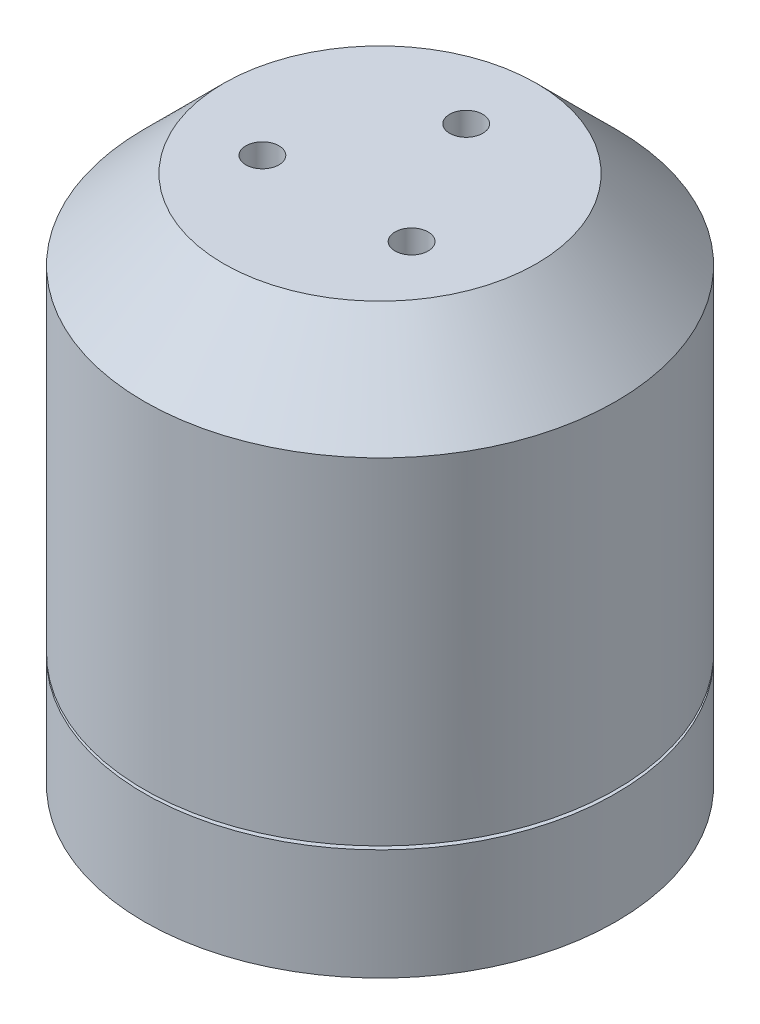
ISO-10303-21;
HEADER;
FILE_DESCRIPTION(('STEP AP214'),'2;1');
FILE_NAME('part.step','',(''),(''),'','','');
FILE_SCHEMA(('AUTOMOTIVE_DESIGN { 1 0 10303 214 1 1 1 1 }'));
ENDSEC;
DATA;
#1=APPLICATION_CONTEXT('core data for automotive mechanical design processes');
#2=APPLICATION_PROTOCOL_DEFINITION('international standard','automotive_design',2000,#1);
#3=PRODUCT_CONTEXT('',#1,'mechanical');
#4=PRODUCT('Part','Part','',(#3));
#5=PRODUCT_RELATED_PRODUCT_CATEGORY('part','',(#4));
#6=PRODUCT_DEFINITION_FORMATION('','',#4);
#7=PRODUCT_DEFINITION_CONTEXT('part definition',#1,'design');
#8=PRODUCT_DEFINITION('design','',#6,#7);
#9=PRODUCT_DEFINITION_SHAPE('','',#8);
#10=(LENGTH_UNIT() NAMED_UNIT(*) SI_UNIT(.MILLI.,.METRE.));
#11=(NAMED_UNIT(*) PLANE_ANGLE_UNIT() SI_UNIT($,.RADIAN.));
#12=(NAMED_UNIT(*) SI_UNIT($,.STERADIAN.) SOLID_ANGLE_UNIT());
#13=UNCERTAINTY_MEASURE_WITH_UNIT(LENGTH_MEASURE(1.E-05),#10,'distance_accuracy_value','');
#14=(GEOMETRIC_REPRESENTATION_CONTEXT(3) GLOBAL_UNCERTAINTY_ASSIGNED_CONTEXT((#13)) GLOBAL_UNIT_ASSIGNED_CONTEXT((#10,
#11,#12)) REPRESENTATION_CONTEXT('',''));
#15=CARTESIAN_POINT('',(0.,0.,0.));
#16=DIRECTION('',(0.,0.,1.));
#17=DIRECTION('',(1.,0.,0.));
#18=AXIS2_PLACEMENT_3D('',#15,#16,#17);
#19=CARTESIAN_POINT('',(0.,20.,0.));
#20=DIRECTION('',(0.,-1.,0.));
#21=DIRECTION('',(0.,0.,-1.));
#22=AXIS2_PLACEMENT_3D('',#19,#20,#21);
#23=CYLINDRICAL_SURFACE('',#22,17.8);
#24=CARTESIAN_POINT('',(0.,14.,0.));
#25=DIRECTION('',(0.,1.,0.));
#26=DIRECTION('',(0.,0.,1.));
#27=AXIS2_PLACEMENT_3D('',#24,#25,#26);
#28=CIRCLE('',#27,17.8);
#29=CARTESIAN_POINT('',(0.,14.,17.8));
#30=VERTEX_POINT('',#29);
#31=EDGE_CURVE('E10',#30,#30,#28,.F.);
#32=ORIENTED_EDGE('',*,*,#31,.T.);
#33=EDGE_LOOP('',(#32));
#34=FACE_BOUND('',#33,.T.);
#35=CARTESIAN_POINT('',(0.,-11.364,0.));
#36=DIRECTION('',(0.,-1.,0.));
#37=DIRECTION('',(0.,0.,-1.));
#38=AXIS2_PLACEMENT_3D('',#35,#36,#37);
#39=CIRCLE('',#38,17.8);
#40=CARTESIAN_POINT('',(0.,-11.364,-17.8));
#41=VERTEX_POINT('',#40);
#42=EDGE_CURVE('E54',#41,#41,#39,.T.);
#43=ORIENTED_EDGE('',*,*,#42,.F.);
#44=EDGE_LOOP('',(#43));
#45=FACE_BOUND('',#44,.T.);
#46=ADVANCED_FACE('F34',(#34,#45),#23,.T.);
#47=CARTESIAN_POINT('',(0.,20.,0.));
#48=DIRECTION('',(0.,1.,0.));
#49=DIRECTION('',(0.,0.,1.));
#50=AXIS2_PLACEMENT_3D('',#47,#48,#49);
#51=PLANE('',#50);
#52=CARTESIAN_POINT('',(0.,20.,0.));
#53=DIRECTION('',(0.,1.,0.));
#54=DIRECTION('',(0.,0.,1.));
#55=AXIS2_PLACEMENT_3D('',#52,#53,#54);
#56=CIRCLE('',#55,11.8);
#57=CARTESIAN_POINT('',(0.,20.,11.8));
#58=VERTEX_POINT('',#57);
#59=EDGE_CURVE('E43',#58,#58,#56,.T.);
#60=ORIENTED_EDGE('',*,*,#59,.T.);
#61=EDGE_LOOP('',(#60));
#62=FACE_BOUND('',#61,.T.);
#63=CARTESIAN_POINT('',(5.62916512459884,20.,3.25000000000003));
#64=DIRECTION('',(0.,1.,0.));
#65=DIRECTION('',(-0.866025403784436,0.,-0.500000000000004));
#66=AXIS2_PLACEMENT_3D('',#63,#64,#65);
#67=CIRCLE('',#66,1.25);
#68=CARTESIAN_POINT('',(4.54663336986829,20.,2.62500000000002));
#69=VERTEX_POINT('',#68);
#70=EDGE_CURVE('E115',#69,#69,#67,.T.);
#71=ORIENTED_EDGE('',*,*,#70,.F.);
#72=EDGE_LOOP('',(#71));
#73=FACE_BOUND('',#72,.T.);
#74=CARTESIAN_POINT('',(-5.62916512459888,20.,3.24999999999995));
#75=DIRECTION('',(0.,1.,0.));
#76=DIRECTION('',(0.866025403784443,0.,-0.499999999999992));
#77=AXIS2_PLACEMENT_3D('',#74,#75,#76);
#78=CIRCLE('',#77,1.25);
#79=CARTESIAN_POINT('',(-4.54663336986833,20.,2.62499999999996));
#80=VERTEX_POINT('',#79);
#81=EDGE_CURVE('E108',#80,#80,#78,.T.);
#82=ORIENTED_EDGE('',*,*,#81,.F.);
#83=EDGE_LOOP('',(#82));
#84=FACE_BOUND('',#83,.T.);
#85=CARTESIAN_POINT('',(0.,20.,-6.5));
#86=DIRECTION('',(0.,1.,0.));
#87=DIRECTION('',(0.,0.,1.));
#88=AXIS2_PLACEMENT_3D('',#85,#86,#87);
#89=CIRCLE('',#88,1.25);
#90=CARTESIAN_POINT('',(0.,20.,-5.25));
#91=VERTEX_POINT('',#90);
#92=EDGE_CURVE('E114',#91,#91,#89,.T.);
#93=ORIENTED_EDGE('',*,*,#92,.F.);
#94=EDGE_LOOP('',(#93));
#95=FACE_BOUND('',#94,.T.);
#96=ADVANCED_FACE('F152',(#62,#73,#84,#95),#51,.T.);
#97=CARTESIAN_POINT('',(0.,7.3,-6.5));
#98=DIRECTION('',(0.,1.,0.));
#99=DIRECTION('',(0.,0.,1.));
#100=AXIS2_PLACEMENT_3D('',#97,#98,#99);
#101=CYLINDRICAL_SURFACE('',#100,1.25);
#102=CARTESIAN_POINT('',(0.,7.3,-6.5));
#103=DIRECTION('',(0.,1.,0.));
#104=DIRECTION('',(0.,0.,1.));
#105=AXIS2_PLACEMENT_3D('',#102,#103,#104);
#106=CIRCLE('',#105,1.25);
#107=CARTESIAN_POINT('',(0.,7.3,-5.25));
#108=VERTEX_POINT('',#107);
#109=EDGE_CURVE('E123',#108,#108,#106,.T.);
#110=ORIENTED_EDGE('',*,*,#109,.F.);
#111=EDGE_LOOP('',(#110));
#112=FACE_BOUND('',#111,.T.);
#113=ORIENTED_EDGE('',*,*,#92,.T.);
#114=EDGE_LOOP('',(#113));
#115=FACE_BOUND('',#114,.T.);
#116=ADVANCED_FACE('F156',(#112,#115),#101,.F.);
#117=CARTESIAN_POINT('',(0.,7.3,-6.5));
#118=DIRECTION('',(0.,1.,0.));
#119=DIRECTION('',(0.,0.,1.));
#120=AXIS2_PLACEMENT_3D('',#117,#118,#119);
#121=PLANE('',#120);
#122=ORIENTED_EDGE('',*,*,#109,.T.);
#123=EDGE_LOOP('',(#122));
#124=FACE_BOUND('',#123,.T.);
#125=ADVANCED_FACE('F297',(#124),#121,.T.);
#126=CARTESIAN_POINT('',(-5.62916512459888,7.3,3.24999999999995));
#127=DIRECTION('',(0.,1.,0.));
#128=DIRECTION('',(0.,0.,1.));
#129=AXIS2_PLACEMENT_3D('',#126,#127,#128);
#130=CYLINDRICAL_SURFACE('',#129,1.25);
#131=CARTESIAN_POINT('',(-5.62916512459888,7.3,3.24999999999995));
#132=DIRECTION('',(0.,1.,0.));
#133=DIRECTION('',(0.866025403784443,0.,-0.499999999999992));
#134=AXIS2_PLACEMENT_3D('',#131,#132,#133);
#135=CIRCLE('',#134,1.25);
#136=CARTESIAN_POINT('',(-4.54663336986833,7.3,2.62499999999996));
#137=VERTEX_POINT('',#136);
#138=EDGE_CURVE('E118',#137,#137,#135,.T.);
#139=ORIENTED_EDGE('',*,*,#138,.F.);
#140=EDGE_LOOP('',(#139));
#141=FACE_BOUND('',#140,.T.);
#142=ORIENTED_EDGE('',*,*,#81,.T.);
#143=EDGE_LOOP('',(#142));
#144=FACE_BOUND('',#143,.T.);
#145=ADVANCED_FACE('F305',(#141,#144),#130,.F.);
#146=CARTESIAN_POINT('',(-5.62916512459888,7.3,3.24999999999995));
#147=DIRECTION('',(0.,1.,0.));
#148=DIRECTION('',(0.866025403784443,0.,-0.499999999999992));
#149=AXIS2_PLACEMENT_3D('',#146,#147,#148);
#150=PLANE('',#149);
#151=ORIENTED_EDGE('',*,*,#138,.T.);
#152=EDGE_LOOP('',(#151));
#153=FACE_BOUND('',#152,.T.);
#154=ADVANCED_FACE('F313',(#153),#150,.T.);
#155=CARTESIAN_POINT('',(5.62916512459884,7.3,3.25000000000003));
#156=DIRECTION('',(0.,1.,0.));
#157=DIRECTION('',(0.,0.,1.));
#158=AXIS2_PLACEMENT_3D('',#155,#156,#157);
#159=CYLINDRICAL_SURFACE('',#158,1.25);
#160=CARTESIAN_POINT('',(5.62916512459884,7.3,3.25000000000003));
#161=DIRECTION('',(0.,1.,0.));
#162=DIRECTION('',(-0.866025403784436,0.,-0.500000000000004));
#163=AXIS2_PLACEMENT_3D('',#160,#161,#162);
#164=CIRCLE('',#163,1.25);
#165=CARTESIAN_POINT('',(4.54663336986829,7.3,2.62500000000002));
#166=VERTEX_POINT('',#165);
#167=EDGE_CURVE('E111',#166,#166,#164,.T.);
#168=ORIENTED_EDGE('',*,*,#167,.F.);
#169=EDGE_LOOP('',(#168));
#170=FACE_BOUND('',#169,.T.);
#171=ORIENTED_EDGE('',*,*,#70,.T.);
#172=EDGE_LOOP('',(#171));
#173=FACE_BOUND('',#172,.T.);
#174=ADVANCED_FACE('F321',(#170,#173),#159,.F.);
#175=CARTESIAN_POINT('',(5.62916512459884,7.3,3.25000000000003));
#176=DIRECTION('',(0.,1.,0.));
#177=DIRECTION('',(-0.866025403784436,0.,-0.500000000000004));
#178=AXIS2_PLACEMENT_3D('',#175,#176,#177);
#179=PLANE('',#178);
#180=ORIENTED_EDGE('',*,*,#167,.T.);
#181=EDGE_LOOP('',(#180));
#182=FACE_BOUND('',#181,.T.);
#183=ADVANCED_FACE('F221',(#182),#179,.T.);
#184=CARTESIAN_POINT('',(0.,20.,0.));
#185=DIRECTION('',(0.,-1.,0.));
#186=DIRECTION('',(0.,0.,-1.));
#187=AXIS2_PLACEMENT_3D('',#184,#185,#186);
#188=CONICAL_SURFACE('',#187,11.8,0.785398163397446);
#189=ORIENTED_EDGE('',*,*,#31,.F.);
#190=EDGE_LOOP('',(#189));
#191=FACE_BOUND('',#190,.T.);
#192=ORIENTED_EDGE('',*,*,#59,.F.);
#193=EDGE_LOOP('',(#192));
#194=FACE_BOUND('',#193,.T.);
#195=ADVANCED_FACE('F37',(#191,#194),#188,.T.);
#196=CARTESIAN_POINT('',(0.,-11.364,0.));
#197=DIRECTION('',(0.,-1.,0.));
#198=DIRECTION('',(0.,0.,-1.));
#199=AXIS2_PLACEMENT_3D('',#196,#197,#198);
#200=PLANE('',#199);
#201=CARTESIAN_POINT('',(0.,-11.364,0.));
#202=DIRECTION('',(0.,-1.,0.));
#203=DIRECTION('',(0.,0.,-1.));
#204=AXIS2_PLACEMENT_3D('',#201,#202,#203);
#205=CIRCLE('',#204,2.5);
#206=CARTESIAN_POINT('',(0.,-11.364,-2.5));
#207=VERTEX_POINT('',#206);
#208=EDGE_CURVE('E66',#207,#207,#205,.T.);
#209=ORIENTED_EDGE('',*,*,#208,.F.);
#210=EDGE_LOOP('',(#209));
#211=FACE_BOUND('',#210,.T.);
#212=ORIENTED_EDGE('',*,*,#42,.T.);
#213=EDGE_LOOP('',(#212));
#214=FACE_BOUND('',#213,.T.);
#215=CARTESIAN_POINT('',(12.5,-11.364,0.));
#216=DIRECTION('',(0.,-1.,0.));
#217=DIRECTION('',(0.,0.,-1.));
#218=AXIS2_PLACEMENT_3D('',#215,#216,#217);
#219=CIRCLE('',#218,1.5);
#220=CARTESIAN_POINT('',(12.5,-11.364,-1.50000000000004));
#221=VERTEX_POINT('',#220);
#222=EDGE_CURVE('E39',#221,#221,#219,.F.);
#223=ORIENTED_EDGE('',*,*,#222,.T.);
#224=EDGE_LOOP('',(#223));
#225=FACE_BOUND('',#224,.T.);
#226=CARTESIAN_POINT('',(0.,-11.364,-12.5));
#227=DIRECTION('',(0.,-1.,0.));
#228=DIRECTION('',(0.,0.,-1.));
#229=AXIS2_PLACEMENT_3D('',#226,#227,#228);
#230=CIRCLE('',#229,1.5);
#231=CARTESIAN_POINT('',(0.,-11.364,-14.));
#232=VERTEX_POINT('',#231);
#233=EDGE_CURVE('E77',#232,#232,#230,.F.);
#234=ORIENTED_EDGE('',*,*,#233,.T.);
#235=EDGE_LOOP('',(#234));
#236=FACE_BOUND('',#235,.T.);
#237=CARTESIAN_POINT('',(-12.5,-11.364,1.30930550206618E-13));
#238=DIRECTION('',(0.,-1.,0.));
#239=DIRECTION('',(0.,0.,-1.));
#240=AXIS2_PLACEMENT_3D('',#237,#238,#239);
#241=CIRCLE('',#240,1.5);
#242=CARTESIAN_POINT('',(-12.5,-11.364,-1.49999999999987));
#243=VERTEX_POINT('',#242);
#244=EDGE_CURVE('E80',#243,#243,#241,.F.);
#245=ORIENTED_EDGE('',*,*,#244,.T.);
#246=EDGE_LOOP('',(#245));
#247=FACE_BOUND('',#246,.T.);
#248=CARTESIAN_POINT('',(0.,-11.364,12.5));
#249=DIRECTION('',(0.,-1.,0.));
#250=DIRECTION('',(0.,0.,-1.));
#251=AXIS2_PLACEMENT_3D('',#248,#249,#250);
#252=CIRCLE('',#251,1.5);
#253=CARTESIAN_POINT('',(0.,-11.364,11.));
#254=VERTEX_POINT('',#253);
#255=EDGE_CURVE('E83',#254,#254,#252,.F.);
#256=ORIENTED_EDGE('',*,*,#255,.T.);
#257=EDGE_LOOP('',(#256));
#258=FACE_BOUND('',#257,.T.);
#259=ADVANCED_FACE('F177',(#211,#214,#225,#236,#247,#258),#200,.T.);
#260=CARTESIAN_POINT('',(0.,-11.618,0.));
#261=DIRECTION('',(0.,-1.,0.));
#262=DIRECTION('',(0.,0.,-1.));
#263=AXIS2_PLACEMENT_3D('',#260,#261,#262);
#264=PLANE('',#263);
#265=CARTESIAN_POINT('',(-12.5,-11.618,1.30930550206618E-13));
#266=DIRECTION('',(0.,-1.,0.));
#267=DIRECTION('',(0.,0.,-1.));
#268=AXIS2_PLACEMENT_3D('',#265,#266,#267);
#269=CIRCLE('',#268,1.5);
#270=CARTESIAN_POINT('',(-12.5,-11.618,-1.49999999999987));
#271=VERTEX_POINT('',#270);
#272=EDGE_CURVE('E58',#271,#271,#269,.F.);
#273=ORIENTED_EDGE('',*,*,#272,.F.);
#274=EDGE_LOOP('',(#273));
#275=FACE_BOUND('',#274,.T.);
#276=CARTESIAN_POINT('',(12.5,-11.618,0.));
#277=DIRECTION('',(0.,-1.,0.));
#278=DIRECTION('',(0.,0.,-1.));
#279=AXIS2_PLACEMENT_3D('',#276,#277,#278);
#280=CIRCLE('',#279,1.5);
#281=CARTESIAN_POINT('',(12.5,-11.618,-1.50000000000004));
#282=VERTEX_POINT('',#281);
#283=EDGE_CURVE('E51',#282,#282,#280,.F.);
#284=ORIENTED_EDGE('',*,*,#283,.F.);
#285=EDGE_LOOP('',(#284));
#286=FACE_BOUND('',#285,.T.);
#287=CARTESIAN_POINT('',(0.,-11.618,0.));
#288=DIRECTION('',(0.,-1.,0.));
#289=DIRECTION('',(0.,0.,-1.));
#290=AXIS2_PLACEMENT_3D('',#287,#288,#289);
#291=CIRCLE('',#290,2.5);
#292=CARTESIAN_POINT('',(0.,-11.618,-2.5));
#293=VERTEX_POINT('',#292);
#294=EDGE_CURVE('E69',#293,#293,#291,.T.);
#295=ORIENTED_EDGE('',*,*,#294,.T.);
#296=EDGE_LOOP('',(#295));
#297=FACE_BOUND('',#296,.T.);
#298=CARTESIAN_POINT('',(0.,-11.618,0.));
#299=DIRECTION('',(0.,-1.,0.));
#300=DIRECTION('',(0.,0.,-1.));
#301=AXIS2_PLACEMENT_3D('',#298,#299,#300);
#302=CIRCLE('',#301,17.8);
#303=CARTESIAN_POINT('',(0.,-11.618,-17.8));
#304=VERTEX_POINT('',#303);
#305=EDGE_CURVE('E61',#304,#304,#302,.T.);
#306=ORIENTED_EDGE('',*,*,#305,.F.);
#307=EDGE_LOOP('',(#306));
#308=FACE_BOUND('',#307,.T.);
#309=CARTESIAN_POINT('',(0.,-11.618,-12.5));
#310=DIRECTION('',(0.,-1.,0.));
#311=DIRECTION('',(0.,0.,-1.));
#312=AXIS2_PLACEMENT_3D('',#309,#310,#311);
#313=CIRCLE('',#312,1.5);
#314=CARTESIAN_POINT('',(0.,-11.618,-14.));
#315=VERTEX_POINT('',#314);
#316=EDGE_CURVE('E53',#315,#315,#313,.F.);
#317=ORIENTED_EDGE('',*,*,#316,.F.);
#318=EDGE_LOOP('',(#317));
#319=FACE_BOUND('',#318,.T.);
#320=CARTESIAN_POINT('',(0.,-11.618,12.5));
#321=DIRECTION('',(0.,-1.,0.));
#322=DIRECTION('',(0.,0.,-1.));
#323=AXIS2_PLACEMENT_3D('',#320,#321,#322);
#324=CIRCLE('',#323,1.5);
#325=CARTESIAN_POINT('',(0.,-11.618,11.));
#326=VERTEX_POINT('',#325);
#327=EDGE_CURVE('E74',#326,#326,#324,.F.);
#328=ORIENTED_EDGE('',*,*,#327,.F.);
#329=EDGE_LOOP('',(#328));
#330=FACE_BOUND('',#329,.T.);
#331=ADVANCED_FACE('F173',(#275,#286,#297,#308,#319,#330),#264,.F.);
#332=CARTESIAN_POINT('',(0.,-11.364,0.));
#333=DIRECTION('',(0.,-1.,0.));
#334=DIRECTION('',(0.,0.,-1.));
#335=AXIS2_PLACEMENT_3D('',#332,#333,#334);
#336=CYLINDRICAL_SURFACE('',#335,2.5);
#337=ORIENTED_EDGE('',*,*,#208,.T.);
#338=EDGE_LOOP('',(#337));
#339=FACE_BOUND('',#338,.T.);
#340=ORIENTED_EDGE('',*,*,#294,.F.);
#341=EDGE_LOOP('',(#340));
#342=FACE_BOUND('',#341,.T.);
#343=ADVANCED_FACE('F176',(#339,#342),#336,.T.);
#344=CARTESIAN_POINT('',(12.5,-7.3,0.));
#345=DIRECTION('',(0.,-1.,0.));
#346=DIRECTION('',(-1.,0.,0.));
#347=AXIS2_PLACEMENT_3D('',#344,#345,#346);
#348=PLANE('',#347);
#349=CARTESIAN_POINT('',(12.5,-7.3,0.));
#350=DIRECTION('',(0.,-1.,0.));
#351=DIRECTION('',(-1.,0.,0.));
#352=AXIS2_PLACEMENT_3D('',#349,#350,#351);
#353=CIRCLE('',#352,1.5);
#354=CARTESIAN_POINT('',(11.,-7.3,0.));
#355=VERTEX_POINT('',#354);
#356=EDGE_CURVE('E87',#355,#355,#353,.T.);
#357=ORIENTED_EDGE('',*,*,#356,.T.);
#358=EDGE_LOOP('',(#357));
#359=FACE_BOUND('',#358,.T.);
#360=ADVANCED_FACE('F226',(#359),#348,.T.);
#361=CARTESIAN_POINT('',(12.5,-7.3,0.));
#362=DIRECTION('',(0.,-1.,0.));
#363=DIRECTION('',(0.,0.,-1.));
#364=AXIS2_PLACEMENT_3D('',#361,#362,#363);
#365=CYLINDRICAL_SURFACE('',#364,1.5);
#366=ORIENTED_EDGE('',*,*,#356,.F.);
#367=EDGE_LOOP('',(#366));
#368=FACE_BOUND('',#367,.T.);
#369=ORIENTED_EDGE('',*,*,#222,.F.);
#370=EDGE_LOOP('',(#369));
#371=FACE_BOUND('',#370,.T.);
#372=ADVANCED_FACE('F143',(#368,#371),#365,.F.);
#373=CARTESIAN_POINT('',(0.,-7.3,-12.5));
#374=DIRECTION('',(0.,-1.,0.));
#375=DIRECTION('',(0.,0.,1.));
#376=AXIS2_PLACEMENT_3D('',#373,#374,#375);
#377=PLANE('',#376);
#378=CARTESIAN_POINT('',(0.,-7.3,-12.5));
#379=DIRECTION('',(0.,-1.,0.));
#380=DIRECTION('',(0.,0.,1.));
#381=AXIS2_PLACEMENT_3D('',#378,#379,#380);
#382=CIRCLE('',#381,1.5);
#383=CARTESIAN_POINT('',(0.,-7.3,-11.));
#384=VERTEX_POINT('',#383);
#385=EDGE_CURVE('E94',#384,#384,#382,.T.);
#386=ORIENTED_EDGE('',*,*,#385,.T.);
#387=EDGE_LOOP('',(#386));
#388=FACE_BOUND('',#387,.T.);
#389=ADVANCED_FACE('F230',(#388),#377,.T.);
#390=CARTESIAN_POINT('',(0.,-7.3,-12.5));
#391=DIRECTION('',(0.,-1.,0.));
#392=DIRECTION('',(0.,0.,-1.));
#393=AXIS2_PLACEMENT_3D('',#390,#391,#392);
#394=CYLINDRICAL_SURFACE('',#393,1.5);
#395=ORIENTED_EDGE('',*,*,#385,.F.);
#396=EDGE_LOOP('',(#395));
#397=FACE_BOUND('',#396,.T.);
#398=ORIENTED_EDGE('',*,*,#233,.F.);
#399=EDGE_LOOP('',(#398));
#400=FACE_BOUND('',#399,.T.);
#401=ADVANCED_FACE('F147',(#397,#400),#394,.F.);
#402=CARTESIAN_POINT('',(-12.5,-7.3,1.30930550206618E-13));
#403=DIRECTION('',(0.,-1.,0.));
#404=DIRECTION('',(1.,0.,0.));
#405=AXIS2_PLACEMENT_3D('',#402,#403,#404);
#406=PLANE('',#405);
#407=CARTESIAN_POINT('',(-12.5,-7.3,1.30930550206618E-13));
#408=DIRECTION('',(0.,-1.,0.));
#409=DIRECTION('',(1.,0.,0.));
#410=AXIS2_PLACEMENT_3D('',#407,#408,#409);
#411=CIRCLE('',#410,1.5);
#412=CARTESIAN_POINT('',(-11.,-7.3,1.15218884181823E-13));
#413=VERTEX_POINT('',#412);
#414=EDGE_CURVE('E100',#413,#413,#411,.T.);
#415=ORIENTED_EDGE('',*,*,#414,.T.);
#416=EDGE_LOOP('',(#415));
#417=FACE_BOUND('',#416,.T.);
#418=ADVANCED_FACE('F200',(#417),#406,.T.);
#419=CARTESIAN_POINT('',(-12.5,-7.3,1.30930550206618E-13));
#420=DIRECTION('',(0.,-1.,0.));
#421=DIRECTION('',(0.,0.,-1.));
#422=AXIS2_PLACEMENT_3D('',#419,#420,#421);
#423=CYLINDRICAL_SURFACE('',#422,1.5);
#424=ORIENTED_EDGE('',*,*,#414,.F.);
#425=EDGE_LOOP('',(#424));
#426=FACE_BOUND('',#425,.T.);
#427=ORIENTED_EDGE('',*,*,#244,.F.);
#428=EDGE_LOOP('',(#427));
#429=FACE_BOUND('',#428,.T.);
#430=ADVANCED_FACE('F194',(#426,#429),#423,.F.);
#431=CARTESIAN_POINT('',(0.,-7.3,12.5));
#432=DIRECTION('',(0.,-1.,0.));
#433=DIRECTION('',(0.,0.,-1.));
#434=AXIS2_PLACEMENT_3D('',#431,#432,#433);
#435=PLANE('',#434);
#436=CARTESIAN_POINT('',(0.,-7.3,12.5));
#437=DIRECTION('',(0.,-1.,0.));
#438=DIRECTION('',(0.,0.,-1.));
#439=AXIS2_PLACEMENT_3D('',#436,#437,#438);
#440=CIRCLE('',#439,1.5);
#441=CARTESIAN_POINT('',(0.,-7.3,11.));
#442=VERTEX_POINT('',#441);
#443=EDGE_CURVE('E105',#442,#442,#440,.T.);
#444=ORIENTED_EDGE('',*,*,#443,.T.);
#445=EDGE_LOOP('',(#444));
#446=FACE_BOUND('',#445,.T.);
#447=ADVANCED_FACE('F169',(#446),#435,.T.);
#448=CARTESIAN_POINT('',(0.,-7.3,12.5));
#449=DIRECTION('',(0.,-1.,0.));
#450=DIRECTION('',(0.,0.,-1.));
#451=AXIS2_PLACEMENT_3D('',#448,#449,#450);
#452=CYLINDRICAL_SURFACE('',#451,1.5);
#453=ORIENTED_EDGE('',*,*,#443,.F.);
#454=EDGE_LOOP('',(#453));
#455=FACE_BOUND('',#454,.T.);
#456=ORIENTED_EDGE('',*,*,#255,.F.);
#457=EDGE_LOOP('',(#456));
#458=FACE_BOUND('',#457,.T.);
#459=ADVANCED_FACE('F161',(#455,#458),#452,.F.);
#460=ORIENTED_EDGE('',*,*,#305,.T.);
#461=EDGE_LOOP('',(#460));
#462=FACE_BOUND('',#461,.T.);
#463=CARTESIAN_POINT('',(0.,-20.,0.));
#464=DIRECTION('',(0.,1.,0.));
#465=DIRECTION('',(0.,0.,1.));
#466=AXIS2_PLACEMENT_3D('',#463,#464,#465);
#467=CIRCLE('',#466,17.8);
#468=CARTESIAN_POINT('',(0.,-20.,17.8));
#469=VERTEX_POINT('',#468);
#470=EDGE_CURVE('E48',#469,#469,#467,.T.);
#471=ORIENTED_EDGE('',*,*,#470,.T.);
#472=EDGE_LOOP('',(#471));
#473=FACE_BOUND('',#472,.T.);
#474=ADVANCED_FACE('F130',(#462,#473),#23,.T.);
#475=ORIENTED_EDGE('',*,*,#327,.T.);
#476=EDGE_LOOP('',(#475));
#477=FACE_BOUND('',#476,.T.);
#478=CARTESIAN_POINT('',(0.,-20.,12.5));
#479=DIRECTION('',(0.,-1.,0.));
#480=DIRECTION('',(0.,0.,-1.));
#481=AXIS2_PLACEMENT_3D('',#478,#479,#480);
#482=CIRCLE('',#481,1.5);
#483=CARTESIAN_POINT('',(0.,-20.,11.));
#484=VERTEX_POINT('',#483);
#485=EDGE_CURVE('E90',#484,#484,#482,.T.);
#486=ORIENTED_EDGE('',*,*,#485,.T.);
#487=EDGE_LOOP('',(#486));
#488=FACE_BOUND('',#487,.T.);
#489=ADVANCED_FACE('F160',(#477,#488),#452,.F.);
#490=ORIENTED_EDGE('',*,*,#272,.T.);
#491=EDGE_LOOP('',(#490));
#492=FACE_BOUND('',#491,.T.);
#493=CARTESIAN_POINT('',(-12.5,-20.,1.30930550206618E-13));
#494=DIRECTION('',(0.,-1.,0.));
#495=DIRECTION('',(1.,0.,0.));
#496=AXIS2_PLACEMENT_3D('',#493,#494,#495);
#497=CIRCLE('',#496,1.5);
#498=CARTESIAN_POINT('',(-11.,-20.,1.15218884181823E-13));
#499=VERTEX_POINT('',#498);
#500=EDGE_CURVE('E86',#499,#499,#497,.T.);
#501=ORIENTED_EDGE('',*,*,#500,.T.);
#502=EDGE_LOOP('',(#501));
#503=FACE_BOUND('',#502,.T.);
#504=ADVANCED_FACE('F144',(#492,#503),#423,.F.);
#505=ORIENTED_EDGE('',*,*,#316,.T.);
#506=EDGE_LOOP('',(#505));
#507=FACE_BOUND('',#506,.T.);
#508=CARTESIAN_POINT('',(0.,-20.,-12.5));
#509=DIRECTION('',(0.,-1.,0.));
#510=DIRECTION('',(0.,0.,1.));
#511=AXIS2_PLACEMENT_3D('',#508,#509,#510);
#512=CIRCLE('',#511,1.5);
#513=CARTESIAN_POINT('',(0.,-20.,-11.));
#514=VERTEX_POINT('',#513);
#515=EDGE_CURVE('E97',#514,#514,#512,.T.);
#516=ORIENTED_EDGE('',*,*,#515,.T.);
#517=EDGE_LOOP('',(#516));
#518=FACE_BOUND('',#517,.T.);
#519=ADVANCED_FACE('F135',(#507,#518),#394,.F.);
#520=CARTESIAN_POINT('',(0.,-20.,0.));
#521=DIRECTION('',(0.,1.,0.));
#522=DIRECTION('',(0.,0.,1.));
#523=AXIS2_PLACEMENT_3D('',#520,#521,#522);
#524=PLANE('',#523);
#525=CARTESIAN_POINT('',(12.5,-20.,0.));
#526=DIRECTION('',(0.,-1.,0.));
#527=DIRECTION('',(-1.,0.,0.));
#528=AXIS2_PLACEMENT_3D('',#525,#526,#527);
#529=CIRCLE('',#528,1.5);
#530=CARTESIAN_POINT('',(11.,-20.,0.));
#531=VERTEX_POINT('',#530);
#532=EDGE_CURVE('E91',#531,#531,#529,.T.);
#533=ORIENTED_EDGE('',*,*,#532,.F.);
#534=EDGE_LOOP('',(#533));
#535=FACE_BOUND('',#534,.T.);
#536=ORIENTED_EDGE('',*,*,#515,.F.);
#537=EDGE_LOOP('',(#536));
#538=FACE_BOUND('',#537,.T.);
#539=ORIENTED_EDGE('',*,*,#500,.F.);
#540=EDGE_LOOP('',(#539));
#541=FACE_BOUND('',#540,.T.);
#542=ORIENTED_EDGE('',*,*,#485,.F.);
#543=EDGE_LOOP('',(#542));
#544=FACE_BOUND('',#543,.T.);
#545=ORIENTED_EDGE('',*,*,#470,.F.);
#546=EDGE_LOOP('',(#545));
#547=FACE_BOUND('',#546,.T.);
#548=ADVANCED_FACE('F132',(#535,#538,#541,#544,#547),#524,.F.);
#549=ORIENTED_EDGE('',*,*,#283,.T.);
#550=EDGE_LOOP('',(#549));
#551=FACE_BOUND('',#550,.T.);
#552=ORIENTED_EDGE('',*,*,#532,.T.);
#553=EDGE_LOOP('',(#552));
#554=FACE_BOUND('',#553,.T.);
#555=ADVANCED_FACE('F134',(#551,#554),#365,.F.);
#556=CLOSED_SHELL('',(#46,#96,#116,#125,#145,#154,#174,#183,#195,#259,#331,#343,#360,#372,#389,
#401,#418,#430,#447,#459,#474,#489,#504,#519,#548,#555));
#557=MANIFOLD_SOLID_BREP('B2',#556);
#558=ADVANCED_BREP_SHAPE_REPRESENTATION('',(#18,#557),#14);
#559=SHAPE_DEFINITION_REPRESENTATION(#9,#558);
ENDSEC;
END-ISO-10303-21;
